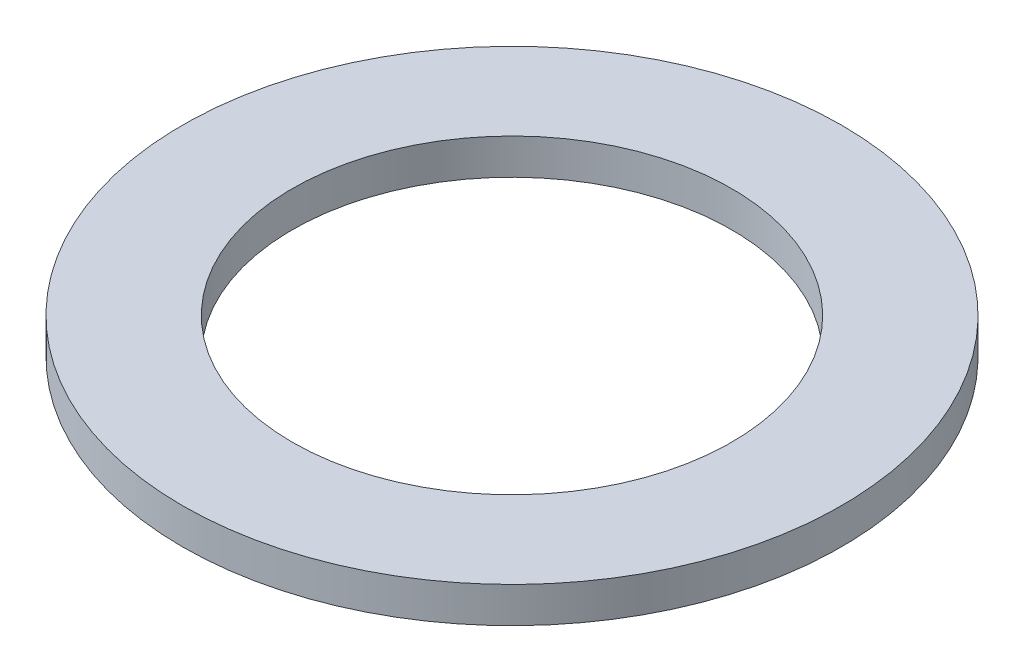
ISO-10303-21;
HEADER;
FILE_DESCRIPTION(('STEP AP214'),'2;1');
FILE_NAME('part.step','',(''),(''),'','','');
FILE_SCHEMA(('AUTOMOTIVE_DESIGN { 1 0 10303 214 1 1 1 1 }'));
ENDSEC;
DATA;
#1=APPLICATION_CONTEXT('core data for automotive mechanical design processes');
#2=APPLICATION_PROTOCOL_DEFINITION('international standard','automotive_design',2000,#1);
#3=PRODUCT_CONTEXT('',#1,'mechanical');
#4=PRODUCT('Part','Part','',(#3));
#5=PRODUCT_RELATED_PRODUCT_CATEGORY('part','',(#4));
#6=PRODUCT_DEFINITION_FORMATION('','',#4);
#7=PRODUCT_DEFINITION_CONTEXT('part definition',#1,'design');
#8=PRODUCT_DEFINITION('design','',#6,#7);
#9=PRODUCT_DEFINITION_SHAPE('','',#8);
#10=(LENGTH_UNIT() NAMED_UNIT(*) SI_UNIT(.MILLI.,.METRE.));
#11=(NAMED_UNIT(*) PLANE_ANGLE_UNIT() SI_UNIT($,.RADIAN.));
#12=(NAMED_UNIT(*) SI_UNIT($,.STERADIAN.) SOLID_ANGLE_UNIT());
#13=UNCERTAINTY_MEASURE_WITH_UNIT(LENGTH_MEASURE(1.E-05),#10,'distance_accuracy_value','');
#14=(GEOMETRIC_REPRESENTATION_CONTEXT(3) GLOBAL_UNCERTAINTY_ASSIGNED_CONTEXT((#13)) GLOBAL_UNIT_ASSIGNED_CONTEXT((#10,
#11,#12)) REPRESENTATION_CONTEXT('',''));
#15=CARTESIAN_POINT('',(0.,0.,0.));
#16=DIRECTION('',(0.,0.,1.));
#17=DIRECTION('',(1.,0.,0.));
#18=AXIS2_PLACEMENT_3D('',#15,#16,#17);
#19=CARTESIAN_POINT('',(0.,1.3,0.));
#20=DIRECTION('',(0.,1.,0.));
#21=DIRECTION('',(0.,0.,1.));
#22=AXIS2_PLACEMENT_3D('',#19,#20,#21);
#23=PLANE('',#22);
#24=CARTESIAN_POINT('',(0.,1.3,0.));
#25=DIRECTION('',(0.,1.,0.));
#26=DIRECTION('',(0.,0.,1.));
#27=AXIS2_PLACEMENT_3D('',#24,#25,#26);
#28=CIRCLE('',#27,12.);
#29=CARTESIAN_POINT('',(0.,1.3,12.));
#30=VERTEX_POINT('',#29);
#31=EDGE_CURVE('E10',#30,#30,#28,.T.);
#32=ORIENTED_EDGE('',*,*,#31,.T.);
#33=EDGE_LOOP('',(#32));
#34=FACE_BOUND('',#33,.T.);
#35=CARTESIAN_POINT('',(0.,1.3,0.));
#36=DIRECTION('',(0.,1.,0.));
#37=DIRECTION('',(0.,0.,1.));
#38=AXIS2_PLACEMENT_3D('',#35,#36,#37);
#39=CIRCLE('',#38,8.);
#40=CARTESIAN_POINT('',(0.,1.3,8.));
#41=VERTEX_POINT('',#40);
#42=EDGE_CURVE('E42',#41,#41,#39,.T.);
#43=ORIENTED_EDGE('',*,*,#42,.F.);
#44=EDGE_LOOP('',(#43));
#45=FACE_BOUND('',#44,.T.);
#46=ADVANCED_FACE('F31',(#34,#45),#23,.T.);
#47=CARTESIAN_POINT('',(0.,0.,0.));
#48=DIRECTION('',(0.,1.,0.));
#49=DIRECTION('',(0.,0.,1.));
#50=AXIS2_PLACEMENT_3D('',#47,#48,#49);
#51=PLANE('',#50);
#52=CARTESIAN_POINT('',(0.,0.,0.));
#53=DIRECTION('',(0.,1.,0.));
#54=DIRECTION('',(0.,0.,1.));
#55=AXIS2_PLACEMENT_3D('',#52,#53,#54);
#56=CIRCLE('',#55,12.);
#57=CARTESIAN_POINT('',(0.,0.,12.));
#58=VERTEX_POINT('',#57);
#59=EDGE_CURVE('E35',#58,#58,#56,.T.);
#60=ORIENTED_EDGE('',*,*,#59,.F.);
#61=EDGE_LOOP('',(#60));
#62=FACE_BOUND('',#61,.T.);
#63=CARTESIAN_POINT('',(0.,0.,0.));
#64=DIRECTION('',(0.,1.,0.));
#65=DIRECTION('',(0.,0.,1.));
#66=AXIS2_PLACEMENT_3D('',#63,#64,#65);
#67=CIRCLE('',#66,8.);
#68=CARTESIAN_POINT('',(0.,0.,8.));
#69=VERTEX_POINT('',#68);
#70=EDGE_CURVE('E44',#69,#69,#67,.T.);
#71=ORIENTED_EDGE('',*,*,#70,.T.);
#72=EDGE_LOOP('',(#71));
#73=FACE_BOUND('',#72,.T.);
#74=ADVANCED_FACE('F54',(#62,#73),#51,.F.);
#75=CARTESIAN_POINT('',(0.,1.3,0.));
#76=DIRECTION('',(0.,-1.,0.));
#77=DIRECTION('',(0.,0.,-1.));
#78=AXIS2_PLACEMENT_3D('',#75,#76,#77);
#79=CYLINDRICAL_SURFACE('',#78,12.);
#80=ORIENTED_EDGE('',*,*,#31,.F.);
#81=EDGE_LOOP('',(#80));
#82=FACE_BOUND('',#81,.T.);
#83=ORIENTED_EDGE('',*,*,#59,.T.);
#84=EDGE_LOOP('',(#83));
#85=FACE_BOUND('',#84,.T.);
#86=ADVANCED_FACE('F33',(#82,#85),#79,.T.);
#87=CARTESIAN_POINT('',(0.,1.3,0.));
#88=DIRECTION('',(0.,-1.,0.));
#89=DIRECTION('',(0.,0.,-1.));
#90=AXIS2_PLACEMENT_3D('',#87,#88,#89);
#91=CYLINDRICAL_SURFACE('',#90,8.);
#92=ORIENTED_EDGE('',*,*,#42,.T.);
#93=EDGE_LOOP('',(#92));
#94=FACE_BOUND('',#93,.T.);
#95=ORIENTED_EDGE('',*,*,#70,.F.);
#96=EDGE_LOOP('',(#95));
#97=FACE_BOUND('',#96,.T.);
#98=ADVANCED_FACE('F50',(#94,#97),#91,.F.);
#99=CLOSED_SHELL('',(#46,#74,#86,#98));
#100=MANIFOLD_SOLID_BREP('B2',#99);
#101=ADVANCED_BREP_SHAPE_REPRESENTATION('',(#18,#100),#14);
#102=SHAPE_DEFINITION_REPRESENTATION(#9,#101);
ENDSEC;
END-ISO-10303-21;
